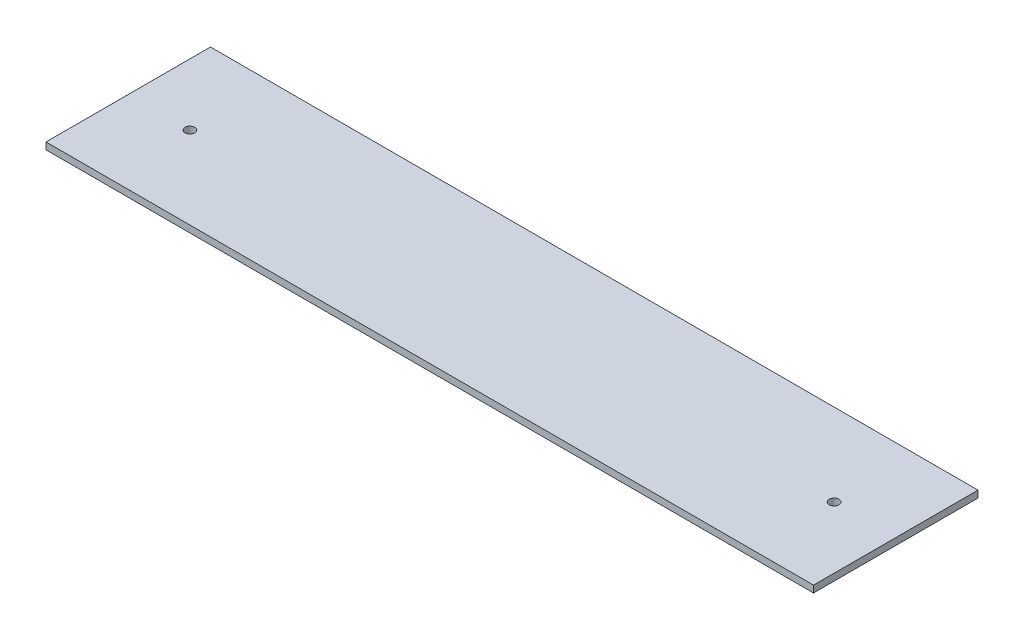
ISO-10303-21;
HEADER;
FILE_DESCRIPTION(('STEP AP214'),'2;1');
FILE_NAME('part.step','',(''),(''),'','','');
FILE_SCHEMA(('AUTOMOTIVE_DESIGN { 1 0 10303 214 1 1 1 1 }'));
ENDSEC;
DATA;
#1=APPLICATION_CONTEXT('core data for automotive mechanical design processes');
#2=APPLICATION_PROTOCOL_DEFINITION('international standard','automotive_design',2000,#1);
#3=PRODUCT_CONTEXT('',#1,'mechanical');
#4=PRODUCT('Part','Part','',(#3));
#5=PRODUCT_RELATED_PRODUCT_CATEGORY('part','',(#4));
#6=PRODUCT_DEFINITION_FORMATION('','',#4);
#7=PRODUCT_DEFINITION_CONTEXT('part definition',#1,'design');
#8=PRODUCT_DEFINITION('design','',#6,#7);
#9=PRODUCT_DEFINITION_SHAPE('','',#8);
#10=(LENGTH_UNIT() NAMED_UNIT(*) SI_UNIT(.MILLI.,.METRE.));
#11=(NAMED_UNIT(*) PLANE_ANGLE_UNIT() SI_UNIT($,.RADIAN.));
#12=(NAMED_UNIT(*) SI_UNIT($,.STERADIAN.) SOLID_ANGLE_UNIT());
#13=UNCERTAINTY_MEASURE_WITH_UNIT(LENGTH_MEASURE(1.E-05),#10,'distance_accuracy_value','');
#14=(GEOMETRIC_REPRESENTATION_CONTEXT(3) GLOBAL_UNCERTAINTY_ASSIGNED_CONTEXT((#13)) GLOBAL_UNIT_ASSIGNED_CONTEXT((#10,
#11,#12)) REPRESENTATION_CONTEXT('',''));
#15=CARTESIAN_POINT('',(0.,0.,0.));
#16=DIRECTION('',(0.,0.,1.));
#17=DIRECTION('',(1.,0.,0.));
#18=AXIS2_PLACEMENT_3D('',#15,#16,#17);
#19=CARTESIAN_POINT('',(177.8,-3.175,38.1));
#20=DIRECTION('',(1.,0.,0.));
#21=DIRECTION('',(0.,0.,-1.));
#22=AXIS2_PLACEMENT_3D('',#19,#20,#21);
#23=PLANE('',#22);
#24=DIRECTION('',(0.,0.,-1.));
#25=VECTOR('',#24,1.);
#26=CARTESIAN_POINT('',(177.8,0.,38.1));
#27=LINE('',#26,#25);
#28=CARTESIAN_POINT('',(177.8,0.,38.1));
#29=VERTEX_POINT('',#28);
#30=CARTESIAN_POINT('',(177.8,0.,-38.1));
#31=VERTEX_POINT('',#30);
#32=EDGE_CURVE('E103',#29,#31,#27,.T.);
#33=ORIENTED_EDGE('',*,*,#32,.F.);
#34=DIRECTION('',(0.,1.,0.));
#35=VECTOR('',#34,1.);
#36=CARTESIAN_POINT('',(177.8,-3.175,38.1));
#37=LINE('',#36,#35);
#38=CARTESIAN_POINT('',(177.8,-3.175,38.1));
#39=VERTEX_POINT('',#38);
#40=EDGE_CURVE('E11',#39,#29,#37,.T.);
#41=ORIENTED_EDGE('',*,*,#40,.F.);
#42=DIRECTION('',(0.,0.,-1.));
#43=VECTOR('',#42,1.);
#44=CARTESIAN_POINT('',(177.8,-3.175,38.1));
#45=LINE('',#44,#43);
#46=CARTESIAN_POINT('',(177.8,-3.175,-38.1));
#47=VERTEX_POINT('',#46);
#48=EDGE_CURVE('E96',#39,#47,#45,.T.);
#49=ORIENTED_EDGE('',*,*,#48,.T.);
#50=DIRECTION('',(0.,1.,0.));
#51=VECTOR('',#50,1.);
#52=CARTESIAN_POINT('',(177.8,-3.175,-38.1));
#53=LINE('',#52,#51);
#54=EDGE_CURVE('E41',#47,#31,#53,.T.);
#55=ORIENTED_EDGE('',*,*,#54,.T.);
#56=EDGE_LOOP('',(#33,#41,#49,#55));
#57=FACE_BOUND('',#56,.T.);
#58=ADVANCED_FACE('F38',(#57),#23,.T.);
#59=CARTESIAN_POINT('',(-177.8,-3.175,38.1));
#60=DIRECTION('',(0.,0.,1.));
#61=DIRECTION('',(1.,0.,0.));
#62=AXIS2_PLACEMENT_3D('',#59,#60,#61);
#63=PLANE('',#62);
#64=DIRECTION('',(1.,0.,0.));
#65=VECTOR('',#64,1.);
#66=CARTESIAN_POINT('',(-177.8,0.,38.1));
#67=LINE('',#66,#65);
#68=CARTESIAN_POINT('',(-177.8,0.,38.1));
#69=VERTEX_POINT('',#68);
#70=EDGE_CURVE('E98',#69,#29,#67,.T.);
#71=ORIENTED_EDGE('',*,*,#70,.F.);
#72=DIRECTION('',(0.,1.,0.));
#73=VECTOR('',#72,1.);
#74=CARTESIAN_POINT('',(-177.8,-3.175,38.1));
#75=LINE('',#74,#73);
#76=CARTESIAN_POINT('',(-177.8,-3.175,38.1));
#77=VERTEX_POINT('',#76);
#78=EDGE_CURVE('E47',#77,#69,#75,.T.);
#79=ORIENTED_EDGE('',*,*,#78,.F.);
#80=DIRECTION('',(1.,0.,0.));
#81=VECTOR('',#80,1.);
#82=CARTESIAN_POINT('',(-177.8,-3.175,38.1));
#83=LINE('',#82,#81);
#84=EDGE_CURVE('E93',#77,#39,#83,.T.);
#85=ORIENTED_EDGE('',*,*,#84,.T.);
#86=ORIENTED_EDGE('',*,*,#40,.T.);
#87=EDGE_LOOP('',(#71,#79,#85,#86));
#88=FACE_BOUND('',#87,.T.);
#89=ADVANCED_FACE('F114',(#88),#63,.T.);
#90=CARTESIAN_POINT('',(-177.8,-3.175,38.1));
#91=DIRECTION('',(-1.,0.,0.));
#92=DIRECTION('',(0.,0.,1.));
#93=AXIS2_PLACEMENT_3D('',#90,#91,#92);
#94=PLANE('',#93);
#95=DIRECTION('',(0.,0.,1.));
#96=VECTOR('',#95,1.);
#97=CARTESIAN_POINT('',(-177.8,0.,38.1));
#98=LINE('',#97,#96);
#99=CARTESIAN_POINT('',(-177.8,0.,-38.1));
#100=VERTEX_POINT('',#99);
#101=EDGE_CURVE('E88',#100,#69,#98,.T.);
#102=ORIENTED_EDGE('',*,*,#101,.F.);
#103=DIRECTION('',(0.,1.,0.));
#104=VECTOR('',#103,1.);
#105=CARTESIAN_POINT('',(-177.8,-3.175,-38.1));
#106=LINE('',#105,#104);
#107=CARTESIAN_POINT('',(-177.8,-3.175,-38.1));
#108=VERTEX_POINT('',#107);
#109=EDGE_CURVE('E83',#108,#100,#106,.T.);
#110=ORIENTED_EDGE('',*,*,#109,.F.);
#111=DIRECTION('',(0.,0.,1.));
#112=VECTOR('',#111,1.);
#113=CARTESIAN_POINT('',(-177.8,-3.175,38.1));
#114=LINE('',#113,#112);
#115=EDGE_CURVE('E86',#108,#77,#114,.T.);
#116=ORIENTED_EDGE('',*,*,#115,.T.);
#117=ORIENTED_EDGE('',*,*,#78,.T.);
#118=EDGE_LOOP('',(#102,#110,#116,#117));
#119=FACE_BOUND('',#118,.T.);
#120=ADVANCED_FACE('F85',(#119),#94,.T.);
#121=CARTESIAN_POINT('',(-177.8,-3.175,-38.1));
#122=DIRECTION('',(0.,0.,-1.));
#123=DIRECTION('',(-1.,0.,0.));
#124=AXIS2_PLACEMENT_3D('',#121,#122,#123);
#125=PLANE('',#124);
#126=DIRECTION('',(-1.,0.,0.));
#127=VECTOR('',#126,1.);
#128=CARTESIAN_POINT('',(-177.8,0.,-38.1));
#129=LINE('',#128,#127);
#130=EDGE_CURVE('E106',#31,#100,#129,.T.);
#131=ORIENTED_EDGE('',*,*,#130,.F.);
#132=ORIENTED_EDGE('',*,*,#54,.F.);
#133=DIRECTION('',(-1.,0.,0.));
#134=VECTOR('',#133,1.);
#135=CARTESIAN_POINT('',(-177.8,-3.175,-38.1));
#136=LINE('',#135,#134);
#137=EDGE_CURVE('E92',#47,#108,#136,.T.);
#138=ORIENTED_EDGE('',*,*,#137,.T.);
#139=ORIENTED_EDGE('',*,*,#109,.T.);
#140=EDGE_LOOP('',(#131,#132,#138,#139));
#141=FACE_BOUND('',#140,.T.);
#142=ADVANCED_FACE('F95',(#141),#125,.T.);
#143=CARTESIAN_POINT('',(0.,-3.175,0.));
#144=DIRECTION('',(0.,-1.,0.));
#145=DIRECTION('',(0.,0.,-1.));
#146=AXIS2_PLACEMENT_3D('',#143,#144,#145);
#147=PLANE('',#146);
#148=CARTESIAN_POINT('',(149.225,-3.175,0.));
#149=DIRECTION('',(0.,1.,0.));
#150=DIRECTION('',(0.,0.,1.));
#151=AXIS2_PLACEMENT_3D('',#148,#149,#150);
#152=CIRCLE('',#151,2.25000000000001);
#153=CARTESIAN_POINT('',(149.225,-3.175,2.25000000000002));
#154=VERTEX_POINT('',#153);
#155=EDGE_CURVE('E147',#154,#154,#152,.T.);
#156=ORIENTED_EDGE('',*,*,#155,.T.);
#157=EDGE_LOOP('',(#156));
#158=FACE_BOUND('',#157,.T.);
#159=CARTESIAN_POINT('',(-149.225,-3.175,0.));
#160=DIRECTION('',(0.,1.,0.));
#161=DIRECTION('',(0.,0.,1.));
#162=AXIS2_PLACEMENT_3D('',#159,#160,#161);
#163=CIRCLE('',#162,2.25000000000001);
#164=CARTESIAN_POINT('',(-149.225,-3.175,2.25000000000002));
#165=VERTEX_POINT('',#164);
#166=EDGE_CURVE('E107',#165,#165,#163,.T.);
#167=ORIENTED_EDGE('',*,*,#166,.T.);
#168=EDGE_LOOP('',(#167));
#169=FACE_BOUND('',#168,.T.);
#170=ORIENTED_EDGE('',*,*,#48,.F.);
#171=ORIENTED_EDGE('',*,*,#84,.F.);
#172=ORIENTED_EDGE('',*,*,#115,.F.);
#173=ORIENTED_EDGE('',*,*,#137,.F.);
#174=EDGE_LOOP('',(#170,#171,#172,#173));
#175=FACE_BOUND('',#174,.T.);
#176=ADVANCED_FACE('F91',(#158,#169,#175),#147,.T.);
#177=CARTESIAN_POINT('',(0.,0.,0.));
#178=DIRECTION('',(0.,-1.,0.));
#179=DIRECTION('',(0.,0.,-1.));
#180=AXIS2_PLACEMENT_3D('',#177,#178,#179);
#181=PLANE('',#180);
#182=CARTESIAN_POINT('',(149.225,0.,0.));
#183=DIRECTION('',(0.,1.,0.));
#184=DIRECTION('',(0.,0.,1.));
#185=AXIS2_PLACEMENT_3D('',#182,#183,#184);
#186=CIRCLE('',#185,2.25000000000001);
#187=CARTESIAN_POINT('',(149.225,0.,2.25000000000002));
#188=VERTEX_POINT('',#187);
#189=EDGE_CURVE('E150',#188,#188,#186,.T.);
#190=ORIENTED_EDGE('',*,*,#189,.F.);
#191=EDGE_LOOP('',(#190));
#192=FACE_BOUND('',#191,.T.);
#193=CARTESIAN_POINT('',(-149.225,0.,0.));
#194=DIRECTION('',(0.,1.,0.));
#195=DIRECTION('',(0.,0.,1.));
#196=AXIS2_PLACEMENT_3D('',#193,#194,#195);
#197=CIRCLE('',#196,2.25000000000001);
#198=CARTESIAN_POINT('',(-149.225,0.,2.25000000000002));
#199=VERTEX_POINT('',#198);
#200=EDGE_CURVE('E152',#199,#199,#197,.T.);
#201=ORIENTED_EDGE('',*,*,#200,.F.);
#202=EDGE_LOOP('',(#201));
#203=FACE_BOUND('',#202,.T.);
#204=ORIENTED_EDGE('',*,*,#32,.T.);
#205=ORIENTED_EDGE('',*,*,#130,.T.);
#206=ORIENTED_EDGE('',*,*,#101,.T.);
#207=ORIENTED_EDGE('',*,*,#70,.T.);
#208=EDGE_LOOP('',(#204,#205,#206,#207));
#209=FACE_BOUND('',#208,.T.);
#210=ADVANCED_FACE('F113',(#192,#203,#209),#181,.F.);
#211=CARTESIAN_POINT('',(-149.225,-3.175,0.));
#212=DIRECTION('',(0.,1.,0.));
#213=DIRECTION('',(0.,0.,1.));
#214=AXIS2_PLACEMENT_3D('',#211,#212,#213);
#215=CYLINDRICAL_SURFACE('',#214,2.25000000000001);
#216=ORIENTED_EDGE('',*,*,#166,.F.);
#217=EDGE_LOOP('',(#216));
#218=FACE_BOUND('',#217,.T.);
#219=ORIENTED_EDGE('',*,*,#200,.T.);
#220=EDGE_LOOP('',(#219));
#221=FACE_BOUND('',#220,.T.);
#222=ADVANCED_FACE('F132',(#218,#221),#215,.F.);
#223=CARTESIAN_POINT('',(149.225,-3.175,0.));
#224=DIRECTION('',(0.,1.,0.));
#225=DIRECTION('',(0.,0.,1.));
#226=AXIS2_PLACEMENT_3D('',#223,#224,#225);
#227=CYLINDRICAL_SURFACE('',#226,2.25000000000001);
#228=ORIENTED_EDGE('',*,*,#155,.F.);
#229=EDGE_LOOP('',(#228));
#230=FACE_BOUND('',#229,.T.);
#231=ORIENTED_EDGE('',*,*,#189,.T.);
#232=EDGE_LOOP('',(#231));
#233=FACE_BOUND('',#232,.T.);
#234=ADVANCED_FACE('F139',(#230,#233),#227,.F.);
#235=CLOSED_SHELL('',(#58,#89,#120,#142,#176,#210,#222,#234));
#236=MANIFOLD_SOLID_BREP('B2',#235);
#237=ADVANCED_BREP_SHAPE_REPRESENTATION('',(#18,#236),#14);
#238=SHAPE_DEFINITION_REPRESENTATION(#9,#237);
ENDSEC;
END-ISO-10303-21;
